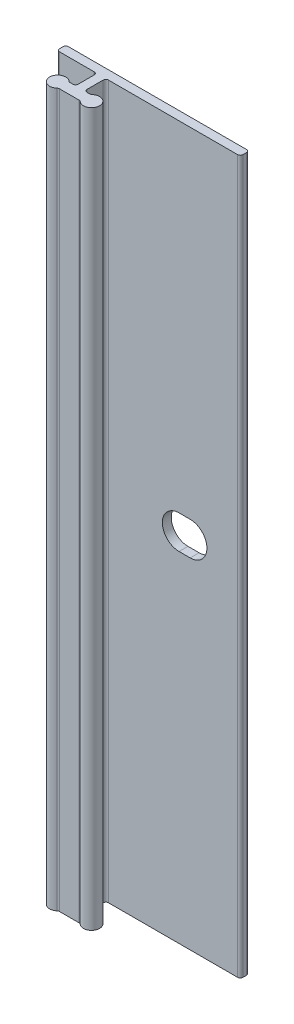
ISO-10303-21;
HEADER;
FILE_DESCRIPTION(('STEP AP214'),'2;1');
FILE_NAME('part.step','',(''),(''),'','','');
FILE_SCHEMA(('AUTOMOTIVE_DESIGN { 1 0 10303 214 1 1 1 1 }'));
ENDSEC;
DATA;
#1=APPLICATION_CONTEXT('core data for automotive mechanical design processes');
#2=APPLICATION_PROTOCOL_DEFINITION('international standard','automotive_design',2000,#1);
#3=PRODUCT_CONTEXT('',#1,'mechanical');
#4=PRODUCT('Part','Part','',(#3));
#5=PRODUCT_RELATED_PRODUCT_CATEGORY('part','',(#4));
#6=PRODUCT_DEFINITION_FORMATION('','',#4);
#7=PRODUCT_DEFINITION_CONTEXT('part definition',#1,'design');
#8=PRODUCT_DEFINITION('design','',#6,#7);
#9=PRODUCT_DEFINITION_SHAPE('','',#8);
#10=(LENGTH_UNIT() NAMED_UNIT(*) SI_UNIT(.MILLI.,.METRE.));
#11=(NAMED_UNIT(*) PLANE_ANGLE_UNIT() SI_UNIT($,.RADIAN.));
#12=(NAMED_UNIT(*) SI_UNIT($,.STERADIAN.) SOLID_ANGLE_UNIT());
#13=UNCERTAINTY_MEASURE_WITH_UNIT(LENGTH_MEASURE(1.E-05),#10,'distance_accuracy_value','');
#14=(GEOMETRIC_REPRESENTATION_CONTEXT(3) GLOBAL_UNCERTAINTY_ASSIGNED_CONTEXT((#13)) GLOBAL_UNIT_ASSIGNED_CONTEXT((#10,
#11,#12)) REPRESENTATION_CONTEXT('',''));
#15=CARTESIAN_POINT('',(0.,0.,0.));
#16=DIRECTION('',(0.,0.,1.));
#17=DIRECTION('',(1.,0.,0.));
#18=AXIS2_PLACEMENT_3D('',#15,#16,#17);
#19=CARTESIAN_POINT('',(-5.96900000000001,50.8,0.381));
#20=DIRECTION('',(0.,-1.,0.));
#21=DIRECTION('',(0.,0.,-1.));
#22=AXIS2_PLACEMENT_3D('',#19,#20,#21);
#23=CYLINDRICAL_SURFACE('',#22,0.381);
#24=CARTESIAN_POINT('',(-5.96900000000001,-50.8,0.381));
#25=DIRECTION('',(0.,1.,0.));
#26=DIRECTION('',(0.,0.,-1.));
#27=AXIS2_PLACEMENT_3D('',#24,#25,#26);
#28=CIRCLE('',#27,0.381);
#29=CARTESIAN_POINT('',(-5.96900000000001,-50.8,0.));
#30=VERTEX_POINT('',#29);
#31=CARTESIAN_POINT('',(-6.35000000000001,-50.8,0.381000000000002));
#32=VERTEX_POINT('',#31);
#33=EDGE_CURVE('E263',#30,#32,#28,.T.);
#34=ORIENTED_EDGE('',*,*,#33,.T.);
#35=DIRECTION('',(0.,-1.,0.));
#36=VECTOR('',#35,1.);
#37=CARTESIAN_POINT('',(-6.35000000000001,50.8,0.381000000000002));
#38=LINE('',#37,#36);
#39=CARTESIAN_POINT('',(-6.35000000000001,50.8,0.381000000000002));
#40=VERTEX_POINT('',#39);
#41=EDGE_CURVE('E13',#40,#32,#38,.T.);
#42=ORIENTED_EDGE('',*,*,#41,.F.);
#43=CARTESIAN_POINT('',(-5.96900000000001,50.8,0.381));
#44=DIRECTION('',(0.,1.,0.));
#45=DIRECTION('',(0.,0.,-1.));
#46=AXIS2_PLACEMENT_3D('',#43,#44,#45);
#47=CIRCLE('',#46,0.381);
#48=CARTESIAN_POINT('',(-5.96900000000001,50.8,0.));
#49=VERTEX_POINT('',#48);
#50=EDGE_CURVE('E267',#49,#40,#47,.T.);
#51=ORIENTED_EDGE('',*,*,#50,.F.);
#52=DIRECTION('',(0.,-1.,0.));
#53=VECTOR('',#52,1.);
#54=CARTESIAN_POINT('',(-5.96900000000001,50.8,0.));
#55=LINE('',#54,#53);
#56=EDGE_CURVE('E317',#49,#30,#55,.T.);
#57=ORIENTED_EDGE('',*,*,#56,.T.);
#58=EDGE_LOOP('',(#34,#42,#51,#57));
#59=FACE_BOUND('',#58,.T.);
#60=ADVANCED_FACE('F46',(#59),#23,.T.);
#61=CARTESIAN_POINT('',(-6.35000000000001,50.8,0.889000000000004));
#62=DIRECTION('',(1.,0.,0.));
#63=DIRECTION('',(0.,0.,-1.));
#64=AXIS2_PLACEMENT_3D('',#61,#62,#63);
#65=PLANE('',#64);
#66=DIRECTION('',(0.,0.,1.));
#67=VECTOR('',#66,1.);
#68=CARTESIAN_POINT('',(-6.35000000000001,-50.8,0.889000000000004));
#69=LINE('',#68,#67);
#70=CARTESIAN_POINT('',(-6.35000000000001,-50.8,0.889000000000004));
#71=VERTEX_POINT('',#70);
#72=EDGE_CURVE('E320',#32,#71,#69,.T.);
#73=ORIENTED_EDGE('',*,*,#72,.T.);
#74=DIRECTION('',(0.,-1.,0.));
#75=VECTOR('',#74,1.);
#76=CARTESIAN_POINT('',(-6.35000000000001,50.8,0.889000000000004));
#77=LINE('',#76,#75);
#78=CARTESIAN_POINT('',(-6.35000000000001,50.8,0.889000000000004));
#79=VERTEX_POINT('',#78);
#80=EDGE_CURVE('E53',#79,#71,#77,.T.);
#81=ORIENTED_EDGE('',*,*,#80,.F.);
#82=DIRECTION('',(0.,0.,1.));
#83=VECTOR('',#82,1.);
#84=CARTESIAN_POINT('',(-6.35000000000001,50.8,0.889000000000004));
#85=LINE('',#84,#83);
#86=EDGE_CURVE('E270',#40,#79,#85,.T.);
#87=ORIENTED_EDGE('',*,*,#86,.F.);
#88=ORIENTED_EDGE('',*,*,#41,.T.);
#89=EDGE_LOOP('',(#73,#81,#87,#88));
#90=FACE_BOUND('',#89,.T.);
#91=ADVANCED_FACE('F457',(#90),#65,.F.);
#92=CARTESIAN_POINT('',(-5.96900000000001,50.8,0.889000000000004));
#93=DIRECTION('',(0.,-1.,0.));
#94=DIRECTION('',(0.,0.,-1.));
#95=AXIS2_PLACEMENT_3D('',#92,#93,#94);
#96=CYLINDRICAL_SURFACE('',#95,0.381000000000001);
#97=CARTESIAN_POINT('',(-5.96900000000001,-50.8,0.889000000000004));
#98=DIRECTION('',(0.,1.,0.));
#99=DIRECTION('',(0.,0.,-1.));
#100=AXIS2_PLACEMENT_3D('',#97,#98,#99);
#101=CIRCLE('',#100,0.381000000000001);
#102=CARTESIAN_POINT('',(-5.96900000000001,-50.8,1.27000000000001));
#103=VERTEX_POINT('',#102);
#104=EDGE_CURVE('E322',#71,#103,#101,.T.);
#105=ORIENTED_EDGE('',*,*,#104,.T.);
#106=DIRECTION('',(0.,-1.,0.));
#107=VECTOR('',#106,1.);
#108=CARTESIAN_POINT('',(-5.96900000000001,50.8,1.27000000000001));
#109=LINE('',#108,#107);
#110=CARTESIAN_POINT('',(-5.96900000000001,50.8,1.27000000000001));
#111=VERTEX_POINT('',#110);
#112=EDGE_CURVE('E427',#111,#103,#109,.T.);
#113=ORIENTED_EDGE('',*,*,#112,.F.);
#114=CARTESIAN_POINT('',(-5.96900000000001,50.8,0.889000000000004));
#115=DIRECTION('',(0.,1.,0.));
#116=DIRECTION('',(0.,0.,-1.));
#117=AXIS2_PLACEMENT_3D('',#114,#115,#116);
#118=CIRCLE('',#117,0.381000000000001);
#119=EDGE_CURVE('E273',#79,#111,#118,.T.);
#120=ORIENTED_EDGE('',*,*,#119,.F.);
#121=ORIENTED_EDGE('',*,*,#80,.T.);
#122=EDGE_LOOP('',(#105,#113,#120,#121));
#123=FACE_BOUND('',#122,.T.);
#124=ADVANCED_FACE('F434',(#123),#96,.T.);
#125=CARTESIAN_POINT('',(-1.016,50.8,1.27));
#126=DIRECTION('',(0.,0.,-1.));
#127=DIRECTION('',(-1.,0.,0.));
#128=AXIS2_PLACEMENT_3D('',#125,#126,#127);
#129=PLANE('',#128);
#130=DIRECTION('',(1.,0.,0.));
#131=VECTOR('',#130,1.);
#132=CARTESIAN_POINT('',(-1.016,-50.8,1.27));
#133=LINE('',#132,#131);
#134=CARTESIAN_POINT('',(-1.016,-50.8,1.27));
#135=VERTEX_POINT('',#134);
#136=EDGE_CURVE('E324',#103,#135,#133,.T.);
#137=ORIENTED_EDGE('',*,*,#136,.T.);
#138=DIRECTION('',(0.,-1.,0.));
#139=VECTOR('',#138,1.);
#140=CARTESIAN_POINT('',(-1.016,50.8,1.27));
#141=LINE('',#140,#139);
#142=CARTESIAN_POINT('',(-1.016,50.8,1.27));
#143=VERTEX_POINT('',#142);
#144=EDGE_CURVE('E424',#143,#135,#141,.T.);
#145=ORIENTED_EDGE('',*,*,#144,.F.);
#146=DIRECTION('',(1.,0.,0.));
#147=VECTOR('',#146,1.);
#148=CARTESIAN_POINT('',(-1.016,50.8,1.27));
#149=LINE('',#148,#147);
#150=EDGE_CURVE('E275',#111,#143,#149,.T.);
#151=ORIENTED_EDGE('',*,*,#150,.F.);
#152=ORIENTED_EDGE('',*,*,#112,.T.);
#153=EDGE_LOOP('',(#137,#145,#151,#152));
#154=FACE_BOUND('',#153,.T.);
#155=ADVANCED_FACE('F445',(#154),#129,.F.);
#156=CARTESIAN_POINT('',(-1.016,50.8,1.651));
#157=DIRECTION('',(0.,-1.,0.));
#158=DIRECTION('',(0.,0.,-1.));
#159=AXIS2_PLACEMENT_3D('',#156,#157,#158);
#160=CYLINDRICAL_SURFACE('',#159,0.381);
#161=CARTESIAN_POINT('',(-1.016,-50.8,1.651));
#162=DIRECTION('',(0.,-1.,0.));
#163=DIRECTION('',(0.,0.,-1.));
#164=AXIS2_PLACEMENT_3D('',#161,#162,#163);
#165=CIRCLE('',#164,0.381);
#166=CARTESIAN_POINT('',(-0.634999999999999,-50.8,1.651));
#167=VERTEX_POINT('',#166);
#168=EDGE_CURVE('E326',#135,#167,#165,.T.);
#169=ORIENTED_EDGE('',*,*,#168,.T.);
#170=DIRECTION('',(0.,-1.,0.));
#171=VECTOR('',#170,1.);
#172=CARTESIAN_POINT('',(-0.634999999999999,50.8,1.651));
#173=LINE('',#172,#171);
#174=CARTESIAN_POINT('',(-0.634999999999999,50.8,1.651));
#175=VERTEX_POINT('',#174);
#176=EDGE_CURVE('E421',#175,#167,#173,.T.);
#177=ORIENTED_EDGE('',*,*,#176,.F.);
#178=CARTESIAN_POINT('',(-1.016,50.8,1.651));
#179=DIRECTION('',(0.,-1.,0.));
#180=DIRECTION('',(0.,0.,-1.));
#181=AXIS2_PLACEMENT_3D('',#178,#179,#180);
#182=CIRCLE('',#181,0.381);
#183=EDGE_CURVE('E277',#143,#175,#182,.T.);
#184=ORIENTED_EDGE('',*,*,#183,.F.);
#185=ORIENTED_EDGE('',*,*,#144,.T.);
#186=EDGE_LOOP('',(#169,#177,#184,#185));
#187=FACE_BOUND('',#186,.T.);
#188=ADVANCED_FACE('F449',(#187),#160,.F.);
#189=CARTESIAN_POINT('',(-0.634999999999999,50.8,1.651));
#190=DIRECTION('',(1.,0.,0.));
#191=DIRECTION('',(0.,0.,-1.));
#192=AXIS2_PLACEMENT_3D('',#189,#190,#191);
#193=PLANE('',#192);
#194=DIRECTION('',(0.,0.,1.));
#195=VECTOR('',#194,1.);
#196=CARTESIAN_POINT('',(-0.634999999999999,-50.8,1.651));
#197=LINE('',#196,#195);
#198=CARTESIAN_POINT('',(-0.634999999999999,-50.8,3.937));
#199=VERTEX_POINT('',#198);
#200=EDGE_CURVE('E328',#167,#199,#197,.T.);
#201=ORIENTED_EDGE('',*,*,#200,.T.);
#202=DIRECTION('',(0.,-1.,0.));
#203=VECTOR('',#202,1.);
#204=CARTESIAN_POINT('',(-0.634999999999999,50.8,3.937));
#205=LINE('',#204,#203);
#206=CARTESIAN_POINT('',(-0.634999999999999,50.8,3.937));
#207=VERTEX_POINT('',#206);
#208=EDGE_CURVE('E418',#207,#199,#205,.T.);
#209=ORIENTED_EDGE('',*,*,#208,.F.);
#210=DIRECTION('',(0.,0.,1.));
#211=VECTOR('',#210,1.);
#212=CARTESIAN_POINT('',(-0.634999999999999,50.8,1.651));
#213=LINE('',#212,#211);
#214=EDGE_CURVE('E279',#175,#207,#213,.T.);
#215=ORIENTED_EDGE('',*,*,#214,.F.);
#216=ORIENTED_EDGE('',*,*,#176,.T.);
#217=EDGE_LOOP('',(#201,#209,#215,#216));
#218=FACE_BOUND('',#217,.T.);
#219=ADVANCED_FACE('F548',(#218),#193,.F.);
#220=CARTESIAN_POINT('',(-1.016,50.8,3.937));
#221=DIRECTION('',(0.,-1.,0.));
#222=DIRECTION('',(0.,0.,-1.));
#223=AXIS2_PLACEMENT_3D('',#220,#221,#222);
#224=CYLINDRICAL_SURFACE('',#223,0.381);
#225=CARTESIAN_POINT('',(-1.016,-50.8,3.937));
#226=DIRECTION('',(0.,-1.,0.));
#227=DIRECTION('',(0.,0.,-1.));
#228=AXIS2_PLACEMENT_3D('',#225,#226,#227);
#229=CIRCLE('',#228,0.381);
#230=CARTESIAN_POINT('',(-1.016,-50.8,4.318));
#231=VERTEX_POINT('',#230);
#232=EDGE_CURVE('E330',#199,#231,#229,.T.);
#233=ORIENTED_EDGE('',*,*,#232,.T.);
#234=DIRECTION('',(0.,-1.,0.));
#235=VECTOR('',#234,1.);
#236=CARTESIAN_POINT('',(-1.016,50.8,4.318));
#237=LINE('',#236,#235);
#238=CARTESIAN_POINT('',(-1.016,50.8,4.318));
#239=VERTEX_POINT('',#238);
#240=EDGE_CURVE('E415',#239,#231,#237,.T.);
#241=ORIENTED_EDGE('',*,*,#240,.F.);
#242=CARTESIAN_POINT('',(-1.016,50.8,3.937));
#243=DIRECTION('',(0.,-1.,0.));
#244=DIRECTION('',(0.,0.,-1.));
#245=AXIS2_PLACEMENT_3D('',#242,#243,#244);
#246=CIRCLE('',#245,0.381);
#247=EDGE_CURVE('E281',#207,#239,#246,.T.);
#248=ORIENTED_EDGE('',*,*,#247,.F.);
#249=ORIENTED_EDGE('',*,*,#208,.T.);
#250=EDGE_LOOP('',(#233,#241,#248,#249));
#251=FACE_BOUND('',#250,.T.);
#252=ADVANCED_FACE('F546',(#251),#224,.F.);
#253=CARTESIAN_POINT('',(-1.40496875048439,50.8,4.318));
#254=DIRECTION('',(0.,0.,1.));
#255=DIRECTION('',(1.,0.,0.));
#256=AXIS2_PLACEMENT_3D('',#253,#254,#255);
#257=PLANE('',#256);
#258=DIRECTION('',(-1.,0.,0.));
#259=VECTOR('',#258,1.);
#260=CARTESIAN_POINT('',(-1.40496875048439,-50.8,4.318));
#261=LINE('',#260,#259);
#262=CARTESIAN_POINT('',(-1.40496875048439,-50.8,4.318));
#263=VERTEX_POINT('',#262);
#264=EDGE_CURVE('E332',#231,#263,#261,.T.);
#265=ORIENTED_EDGE('',*,*,#264,.T.);
#266=DIRECTION('',(0.,-1.,0.));
#267=VECTOR('',#266,1.);
#268=CARTESIAN_POINT('',(-1.40496875048439,50.8,4.318));
#269=LINE('',#268,#267);
#270=CARTESIAN_POINT('',(-1.40496875048439,50.8,4.318));
#271=VERTEX_POINT('',#270);
#272=EDGE_CURVE('E412',#271,#263,#269,.T.);
#273=ORIENTED_EDGE('',*,*,#272,.F.);
#274=DIRECTION('',(-1.,0.,0.));
#275=VECTOR('',#274,1.);
#276=CARTESIAN_POINT('',(-1.40496875048439,50.8,4.318));
#277=LINE('',#276,#275);
#278=EDGE_CURVE('E283',#239,#271,#277,.T.);
#279=ORIENTED_EDGE('',*,*,#278,.F.);
#280=ORIENTED_EDGE('',*,*,#240,.T.);
#281=EDGE_LOOP('',(#265,#273,#279,#280));
#282=FACE_BOUND('',#281,.T.);
#283=ADVANCED_FACE('F542',(#282),#257,.F.);
#284=CARTESIAN_POINT('',(-1.40496875048439,50.8,3.937));
#285=DIRECTION('',(0.,-1.,0.));
#286=DIRECTION('',(0.,0.,-1.));
#287=AXIS2_PLACEMENT_3D('',#284,#285,#286);
#288=CYLINDRICAL_SURFACE('',#287,0.381);
#289=CARTESIAN_POINT('',(-1.40496875048439,-50.8,3.937));
#290=DIRECTION('',(0.,-1.,0.));
#291=DIRECTION('',(0.,0.,-1.));
#292=AXIS2_PLACEMENT_3D('',#289,#290,#291);
#293=CIRCLE('',#292,0.381);
#294=CARTESIAN_POINT('',(-1.65697656286329,-50.8,4.22275));
#295=VERTEX_POINT('',#294);
#296=EDGE_CURVE('E334',#263,#295,#293,.T.);
#297=ORIENTED_EDGE('',*,*,#296,.T.);
#298=DIRECTION('',(0.,-1.,0.));
#299=VECTOR('',#298,1.);
#300=CARTESIAN_POINT('',(-1.65697656286329,50.8,4.22275));
#301=LINE('',#300,#299);
#302=CARTESIAN_POINT('',(-1.65697656286329,50.8,4.22275));
#303=VERTEX_POINT('',#302);
#304=EDGE_CURVE('E409',#303,#295,#301,.T.);
#305=ORIENTED_EDGE('',*,*,#304,.F.);
#306=CARTESIAN_POINT('',(-1.40496875048439,50.8,3.937));
#307=DIRECTION('',(0.,-1.,0.));
#308=DIRECTION('',(0.,0.,-1.));
#309=AXIS2_PLACEMENT_3D('',#306,#307,#308);
#310=CIRCLE('',#309,0.381);
#311=EDGE_CURVE('E285',#271,#303,#310,.T.);
#312=ORIENTED_EDGE('',*,*,#311,.F.);
#313=ORIENTED_EDGE('',*,*,#272,.T.);
#314=EDGE_LOOP('',(#297,#305,#312,#313));
#315=FACE_BOUND('',#314,.T.);
#316=ADVANCED_FACE('F537',(#315),#288,.F.);
#317=CARTESIAN_POINT('',(-2.413,50.8,5.08));
#318=DIRECTION('',(0.,-1.,0.));
#319=DIRECTION('',(0.,0.,-1.));
#320=AXIS2_PLACEMENT_3D('',#317,#318,#319);
#321=CYLINDRICAL_SURFACE('',#320,1.143);
#322=CARTESIAN_POINT('',(-2.413,-50.8,5.08));
#323=DIRECTION('',(0.,1.,0.));
#324=DIRECTION('',(0.,0.,1.));
#325=AXIS2_PLACEMENT_3D('',#322,#323,#324);
#326=CIRCLE('',#325,1.143);
#327=CARTESIAN_POINT('',(-1.65697656286329,-50.8,5.93725));
#328=VERTEX_POINT('',#327);
#329=EDGE_CURVE('E336',#295,#328,#326,.T.);
#330=ORIENTED_EDGE('',*,*,#329,.T.);
#331=DIRECTION('',(0.,-1.,0.));
#332=VECTOR('',#331,1.);
#333=CARTESIAN_POINT('',(-1.65697656286329,50.8,5.93725));
#334=LINE('',#333,#332);
#335=CARTESIAN_POINT('',(-1.65697656286329,50.8,5.93725));
#336=VERTEX_POINT('',#335);
#337=EDGE_CURVE('E406',#336,#328,#334,.T.);
#338=ORIENTED_EDGE('',*,*,#337,.F.);
#339=CARTESIAN_POINT('',(-2.413,50.8,5.08));
#340=DIRECTION('',(0.,1.,0.));
#341=DIRECTION('',(0.,0.,1.));
#342=AXIS2_PLACEMENT_3D('',#339,#340,#341);
#343=CIRCLE('',#342,1.143);
#344=EDGE_CURVE('E287',#303,#336,#343,.T.);
#345=ORIENTED_EDGE('',*,*,#344,.F.);
#346=ORIENTED_EDGE('',*,*,#304,.T.);
#347=EDGE_LOOP('',(#330,#338,#345,#346));
#348=FACE_BOUND('',#347,.T.);
#349=ADVANCED_FACE('F531',(#348),#321,.T.);
#350=CARTESIAN_POINT('',(-1.40496875048439,50.8,6.223));
#351=DIRECTION('',(0.,-1.,0.));
#352=DIRECTION('',(0.,0.,-1.));
#353=AXIS2_PLACEMENT_3D('',#350,#351,#352);
#354=CYLINDRICAL_SURFACE('',#353,0.381);
#355=CARTESIAN_POINT('',(-1.40496875048439,-50.8,6.223));
#356=DIRECTION('',(0.,-1.,0.));
#357=DIRECTION('',(0.,0.,1.));
#358=AXIS2_PLACEMENT_3D('',#355,#356,#357);
#359=CIRCLE('',#358,0.381);
#360=CARTESIAN_POINT('',(-1.40496875048439,-50.8,5.842));
#361=VERTEX_POINT('',#360);
#362=EDGE_CURVE('E338',#328,#361,#359,.T.);
#363=ORIENTED_EDGE('',*,*,#362,.T.);
#364=DIRECTION('',(0.,-1.,0.));
#365=VECTOR('',#364,1.);
#366=CARTESIAN_POINT('',(-1.40496875048439,50.8,5.842));
#367=LINE('',#366,#365);
#368=CARTESIAN_POINT('',(-1.40496875048439,50.8,5.842));
#369=VERTEX_POINT('',#368);
#370=EDGE_CURVE('E403',#369,#361,#367,.T.);
#371=ORIENTED_EDGE('',*,*,#370,.F.);
#372=CARTESIAN_POINT('',(-1.40496875048439,50.8,6.223));
#373=DIRECTION('',(0.,-1.,0.));
#374=DIRECTION('',(0.,0.,1.));
#375=AXIS2_PLACEMENT_3D('',#372,#373,#374);
#376=CIRCLE('',#375,0.381);
#377=EDGE_CURVE('E289',#336,#369,#376,.T.);
#378=ORIENTED_EDGE('',*,*,#377,.F.);
#379=ORIENTED_EDGE('',*,*,#337,.T.);
#380=EDGE_LOOP('',(#363,#371,#378,#379));
#381=FACE_BOUND('',#380,.T.);
#382=ADVANCED_FACE('F527',(#381),#354,.F.);
#383=CARTESIAN_POINT('',(-1.40496875048439,50.8,5.842));
#384=DIRECTION('',(0.,0.,-1.));
#385=DIRECTION('',(-1.,0.,0.));
#386=AXIS2_PLACEMENT_3D('',#383,#384,#385);
#387=PLANE('',#386);
#388=DIRECTION('',(1.,0.,0.));
#389=VECTOR('',#388,1.);
#390=CARTESIAN_POINT('',(-1.40496875048439,-50.8,5.842));
#391=LINE('',#390,#389);
#392=CARTESIAN_POINT('',(1.40496875048439,-50.8,5.842));
#393=VERTEX_POINT('',#392);
#394=EDGE_CURVE('E340',#361,#393,#391,.T.);
#395=ORIENTED_EDGE('',*,*,#394,.T.);
#396=DIRECTION('',(0.,-1.,0.));
#397=VECTOR('',#396,1.);
#398=CARTESIAN_POINT('',(1.40496875048439,50.8,5.842));
#399=LINE('',#398,#397);
#400=CARTESIAN_POINT('',(1.40496875048439,50.8,5.842));
#401=VERTEX_POINT('',#400);
#402=EDGE_CURVE('E400',#401,#393,#399,.T.);
#403=ORIENTED_EDGE('',*,*,#402,.F.);
#404=DIRECTION('',(1.,0.,0.));
#405=VECTOR('',#404,1.);
#406=CARTESIAN_POINT('',(-1.40496875048439,50.8,5.842));
#407=LINE('',#406,#405);
#408=EDGE_CURVE('E291',#369,#401,#407,.T.);
#409=ORIENTED_EDGE('',*,*,#408,.F.);
#410=ORIENTED_EDGE('',*,*,#370,.T.);
#411=EDGE_LOOP('',(#395,#403,#409,#410));
#412=FACE_BOUND('',#411,.T.);
#413=ADVANCED_FACE('F522',(#412),#387,.F.);
#414=CARTESIAN_POINT('',(1.40496875048439,50.8,6.223));
#415=DIRECTION('',(0.,-1.,0.));
#416=DIRECTION('',(0.,0.,-1.));
#417=AXIS2_PLACEMENT_3D('',#414,#415,#416);
#418=CYLINDRICAL_SURFACE('',#417,0.381);
#419=CARTESIAN_POINT('',(1.40496875048439,-50.8,6.223));
#420=DIRECTION('',(0.,-1.,0.));
#421=DIRECTION('',(0.,0.,-1.));
#422=AXIS2_PLACEMENT_3D('',#419,#420,#421);
#423=CIRCLE('',#422,0.381);
#424=CARTESIAN_POINT('',(1.65697656286329,-50.8,5.93725));
#425=VERTEX_POINT('',#424);
#426=EDGE_CURVE('E342',#393,#425,#423,.T.);
#427=ORIENTED_EDGE('',*,*,#426,.T.);
#428=DIRECTION('',(0.,-1.,0.));
#429=VECTOR('',#428,1.);
#430=CARTESIAN_POINT('',(1.65697656286329,50.8,5.93725));
#431=LINE('',#430,#429);
#432=CARTESIAN_POINT('',(1.65697656286329,50.8,5.93725));
#433=VERTEX_POINT('',#432);
#434=EDGE_CURVE('E397',#433,#425,#431,.T.);
#435=ORIENTED_EDGE('',*,*,#434,.F.);
#436=CARTESIAN_POINT('',(1.40496875048439,50.8,6.223));
#437=DIRECTION('',(0.,-1.,0.));
#438=DIRECTION('',(0.,0.,-1.));
#439=AXIS2_PLACEMENT_3D('',#436,#437,#438);
#440=CIRCLE('',#439,0.381);
#441=EDGE_CURVE('E293',#401,#433,#440,.T.);
#442=ORIENTED_EDGE('',*,*,#441,.F.);
#443=ORIENTED_EDGE('',*,*,#402,.T.);
#444=EDGE_LOOP('',(#427,#435,#442,#443));
#445=FACE_BOUND('',#444,.T.);
#446=ADVANCED_FACE('F516',(#445),#418,.F.);
#447=CARTESIAN_POINT('',(2.413,50.8,5.08));
#448=DIRECTION('',(0.,-1.,0.));
#449=DIRECTION('',(0.,0.,-1.));
#450=AXIS2_PLACEMENT_3D('',#447,#448,#449);
#451=CYLINDRICAL_SURFACE('',#450,1.143);
#452=CARTESIAN_POINT('',(2.413,-50.8,5.08));
#453=DIRECTION('',(0.,1.,0.));
#454=DIRECTION('',(0.,0.,1.));
#455=AXIS2_PLACEMENT_3D('',#452,#453,#454);
#456=CIRCLE('',#455,1.143);
#457=CARTESIAN_POINT('',(1.6569765628633,-50.8,4.22275));
#458=VERTEX_POINT('',#457);
#459=EDGE_CURVE('E344',#425,#458,#456,.T.);
#460=ORIENTED_EDGE('',*,*,#459,.T.);
#461=DIRECTION('',(0.,-1.,0.));
#462=VECTOR('',#461,1.);
#463=CARTESIAN_POINT('',(1.6569765628633,50.8,4.22275));
#464=LINE('',#463,#462);
#465=CARTESIAN_POINT('',(1.6569765628633,50.8,4.22275));
#466=VERTEX_POINT('',#465);
#467=EDGE_CURVE('E394',#466,#458,#464,.T.);
#468=ORIENTED_EDGE('',*,*,#467,.F.);
#469=CARTESIAN_POINT('',(2.413,50.8,5.08));
#470=DIRECTION('',(0.,1.,0.));
#471=DIRECTION('',(0.,0.,1.));
#472=AXIS2_PLACEMENT_3D('',#469,#470,#471);
#473=CIRCLE('',#472,1.143);
#474=EDGE_CURVE('E295',#433,#466,#473,.T.);
#475=ORIENTED_EDGE('',*,*,#474,.F.);
#476=ORIENTED_EDGE('',*,*,#434,.T.);
#477=EDGE_LOOP('',(#460,#468,#475,#476));
#478=FACE_BOUND('',#477,.T.);
#479=ADVANCED_FACE('F512',(#478),#451,.T.);
#480=CARTESIAN_POINT('',(1.40496875048439,50.8,3.937));
#481=DIRECTION('',(0.,-1.,0.));
#482=DIRECTION('',(0.,0.,-1.));
#483=AXIS2_PLACEMENT_3D('',#480,#481,#482);
#484=CYLINDRICAL_SURFACE('',#483,0.381000000000001);
#485=CARTESIAN_POINT('',(1.40496875048439,-50.8,3.937));
#486=DIRECTION('',(0.,-1.,0.));
#487=DIRECTION('',(0.,0.,-1.));
#488=AXIS2_PLACEMENT_3D('',#485,#486,#487);
#489=CIRCLE('',#488,0.381000000000001);
#490=CARTESIAN_POINT('',(1.40496875048439,-50.8,4.318));
#491=VERTEX_POINT('',#490);
#492=EDGE_CURVE('E346',#458,#491,#489,.T.);
#493=ORIENTED_EDGE('',*,*,#492,.T.);
#494=DIRECTION('',(0.,-1.,0.));
#495=VECTOR('',#494,1.);
#496=CARTESIAN_POINT('',(1.40496875048439,50.8,4.318));
#497=LINE('',#496,#495);
#498=CARTESIAN_POINT('',(1.40496875048439,50.8,4.318));
#499=VERTEX_POINT('',#498);
#500=EDGE_CURVE('E391',#499,#491,#497,.T.);
#501=ORIENTED_EDGE('',*,*,#500,.F.);
#502=CARTESIAN_POINT('',(1.40496875048439,50.8,3.937));
#503=DIRECTION('',(0.,-1.,0.));
#504=DIRECTION('',(0.,0.,-1.));
#505=AXIS2_PLACEMENT_3D('',#502,#503,#504);
#506=CIRCLE('',#505,0.381000000000001);
#507=EDGE_CURVE('E297',#466,#499,#506,.T.);
#508=ORIENTED_EDGE('',*,*,#507,.F.);
#509=ORIENTED_EDGE('',*,*,#467,.T.);
#510=EDGE_LOOP('',(#493,#501,#508,#509));
#511=FACE_BOUND('',#510,.T.);
#512=ADVANCED_FACE('F507',(#511),#484,.F.);
#513=CARTESIAN_POINT('',(1.016,50.8,4.318));
#514=DIRECTION('',(0.,0.,1.));
#515=DIRECTION('',(1.,0.,0.));
#516=AXIS2_PLACEMENT_3D('',#513,#514,#515);
#517=PLANE('',#516);
#518=DIRECTION('',(-1.,0.,0.));
#519=VECTOR('',#518,1.);
#520=CARTESIAN_POINT('',(1.016,-50.8,4.318));
#521=LINE('',#520,#519);
#522=CARTESIAN_POINT('',(1.016,-50.8,4.318));
#523=VERTEX_POINT('',#522);
#524=EDGE_CURVE('E348',#491,#523,#521,.T.);
#525=ORIENTED_EDGE('',*,*,#524,.T.);
#526=DIRECTION('',(0.,-1.,0.));
#527=VECTOR('',#526,1.);
#528=CARTESIAN_POINT('',(1.016,50.8,4.318));
#529=LINE('',#528,#527);
#530=CARTESIAN_POINT('',(1.016,50.8,4.318));
#531=VERTEX_POINT('',#530);
#532=EDGE_CURVE('E388',#531,#523,#529,.T.);
#533=ORIENTED_EDGE('',*,*,#532,.F.);
#534=DIRECTION('',(-1.,0.,0.));
#535=VECTOR('',#534,1.);
#536=CARTESIAN_POINT('',(1.016,50.8,4.318));
#537=LINE('',#536,#535);
#538=EDGE_CURVE('E299',#499,#531,#537,.T.);
#539=ORIENTED_EDGE('',*,*,#538,.F.);
#540=ORIENTED_EDGE('',*,*,#500,.T.);
#541=EDGE_LOOP('',(#525,#533,#539,#540));
#542=FACE_BOUND('',#541,.T.);
#543=ADVANCED_FACE('F501',(#542),#517,.F.);
#544=CARTESIAN_POINT('',(1.016,50.8,3.937));
#545=DIRECTION('',(0.,-1.,0.));
#546=DIRECTION('',(0.,0.,-1.));
#547=AXIS2_PLACEMENT_3D('',#544,#545,#546);
#548=CYLINDRICAL_SURFACE('',#547,0.381);
#549=CARTESIAN_POINT('',(1.016,-50.8,3.937));
#550=DIRECTION('',(0.,-1.,0.));
#551=DIRECTION('',(0.,0.,1.));
#552=AXIS2_PLACEMENT_3D('',#549,#550,#551);
#553=CIRCLE('',#552,0.381);
#554=CARTESIAN_POINT('',(0.635000000000002,-50.8,3.937));
#555=VERTEX_POINT('',#554);
#556=EDGE_CURVE('E350',#523,#555,#553,.T.);
#557=ORIENTED_EDGE('',*,*,#556,.T.);
#558=DIRECTION('',(0.,-1.,0.));
#559=VECTOR('',#558,1.);
#560=CARTESIAN_POINT('',(0.635000000000002,50.8,3.937));
#561=LINE('',#560,#559);
#562=CARTESIAN_POINT('',(0.635000000000002,50.8,3.937));
#563=VERTEX_POINT('',#562);
#564=EDGE_CURVE('E385',#563,#555,#561,.T.);
#565=ORIENTED_EDGE('',*,*,#564,.F.);
#566=CARTESIAN_POINT('',(1.016,50.8,3.937));
#567=DIRECTION('',(0.,-1.,0.));
#568=DIRECTION('',(0.,0.,1.));
#569=AXIS2_PLACEMENT_3D('',#566,#567,#568);
#570=CIRCLE('',#569,0.381);
#571=EDGE_CURVE('E301',#531,#563,#570,.T.);
#572=ORIENTED_EDGE('',*,*,#571,.F.);
#573=ORIENTED_EDGE('',*,*,#532,.T.);
#574=EDGE_LOOP('',(#557,#565,#572,#573));
#575=FACE_BOUND('',#574,.T.);
#576=ADVANCED_FACE('F497',(#575),#548,.F.);
#577=CARTESIAN_POINT('',(0.635000000000001,50.8,1.651));
#578=DIRECTION('',(-1.,0.,0.));
#579=DIRECTION('',(0.,0.,1.));
#580=AXIS2_PLACEMENT_3D('',#577,#578,#579);
#581=PLANE('',#580);
#582=DIRECTION('',(0.,0.,-1.));
#583=VECTOR('',#582,1.);
#584=CARTESIAN_POINT('',(0.635000000000001,-50.8,1.651));
#585=LINE('',#584,#583);
#586=CARTESIAN_POINT('',(0.635000000000001,-50.8,1.651));
#587=VERTEX_POINT('',#586);
#588=EDGE_CURVE('E352',#555,#587,#585,.T.);
#589=ORIENTED_EDGE('',*,*,#588,.T.);
#590=DIRECTION('',(0.,-1.,0.));
#591=VECTOR('',#590,1.);
#592=CARTESIAN_POINT('',(0.635000000000001,50.8,1.651));
#593=LINE('',#592,#591);
#594=CARTESIAN_POINT('',(0.635000000000001,50.8,1.651));
#595=VERTEX_POINT('',#594);
#596=EDGE_CURVE('E382',#595,#587,#593,.T.);
#597=ORIENTED_EDGE('',*,*,#596,.F.);
#598=DIRECTION('',(0.,0.,-1.));
#599=VECTOR('',#598,1.);
#600=CARTESIAN_POINT('',(0.635000000000001,50.8,1.651));
#601=LINE('',#600,#599);
#602=EDGE_CURVE('E303',#563,#595,#601,.T.);
#603=ORIENTED_EDGE('',*,*,#602,.F.);
#604=ORIENTED_EDGE('',*,*,#564,.T.);
#605=EDGE_LOOP('',(#589,#597,#603,#604));
#606=FACE_BOUND('',#605,.T.);
#607=ADVANCED_FACE('F492',(#606),#581,.F.);
#608=CARTESIAN_POINT('',(1.016,50.8,1.651));
#609=DIRECTION('',(0.,-1.,0.));
#610=DIRECTION('',(0.,0.,-1.));
#611=AXIS2_PLACEMENT_3D('',#608,#609,#610);
#612=CYLINDRICAL_SURFACE('',#611,0.381000000000001);
#613=CARTESIAN_POINT('',(1.016,-50.8,1.651));
#614=DIRECTION('',(0.,-1.,0.));
#615=DIRECTION('',(0.,0.,1.));
#616=AXIS2_PLACEMENT_3D('',#613,#614,#615);
#617=CIRCLE('',#616,0.381000000000001);
#618=CARTESIAN_POINT('',(1.016,-50.8,1.27));
#619=VERTEX_POINT('',#618);
#620=EDGE_CURVE('E354',#587,#619,#617,.T.);
#621=ORIENTED_EDGE('',*,*,#620,.T.);
#622=DIRECTION('',(0.,-1.,0.));
#623=VECTOR('',#622,1.);
#624=CARTESIAN_POINT('',(1.016,50.8,1.27));
#625=LINE('',#624,#623);
#626=CARTESIAN_POINT('',(1.016,50.8,1.27));
#627=VERTEX_POINT('',#626);
#628=EDGE_CURVE('E379',#627,#619,#625,.T.);
#629=ORIENTED_EDGE('',*,*,#628,.F.);
#630=CARTESIAN_POINT('',(1.016,50.8,1.651));
#631=DIRECTION('',(0.,-1.,0.));
#632=DIRECTION('',(0.,0.,1.));
#633=AXIS2_PLACEMENT_3D('',#630,#631,#632);
#634=CIRCLE('',#633,0.381000000000001);
#635=EDGE_CURVE('E305',#595,#627,#634,.T.);
#636=ORIENTED_EDGE('',*,*,#635,.F.);
#637=ORIENTED_EDGE('',*,*,#596,.T.);
#638=EDGE_LOOP('',(#621,#629,#636,#637));
#639=FACE_BOUND('',#638,.T.);
#640=ADVANCED_FACE('F486',(#639),#612,.F.);
#641=CARTESIAN_POINT('',(19.431,50.8,1.27));
#642=DIRECTION('',(0.,0.,-1.));
#643=DIRECTION('',(-1.,0.,0.));
#644=AXIS2_PLACEMENT_3D('',#641,#642,#643);
#645=PLANE('',#644);
#646=DIRECTION('',(1.,0.,0.));
#647=VECTOR('',#646,1.);
#648=CARTESIAN_POINT('',(11.08075,-2.38125,1.27));
#649=LINE('',#648,#647);
#650=CARTESIAN_POINT('',(11.08075,-2.38125,1.27));
#651=VERTEX_POINT('',#650);
#652=CARTESIAN_POINT('',(12.66825,-2.38125,1.27));
#653=VERTEX_POINT('',#652);
#654=EDGE_CURVE('E257',#651,#653,#649,.T.);
#655=ORIENTED_EDGE('',*,*,#654,.F.);
#656=CARTESIAN_POINT('',(11.08075,0.,1.27));
#657=DIRECTION('',(0.,0.,1.));
#658=DIRECTION('',(1.,0.,0.));
#659=AXIS2_PLACEMENT_3D('',#656,#657,#658);
#660=CIRCLE('',#659,2.38125);
#661=CARTESIAN_POINT('',(11.08075,2.38125,1.27));
#662=VERTEX_POINT('',#661);
#663=EDGE_CURVE('E60',#662,#651,#660,.T.);
#664=ORIENTED_EDGE('',*,*,#663,.F.);
#665=DIRECTION('',(-1.,0.,0.));
#666=VECTOR('',#665,1.);
#667=CARTESIAN_POINT('',(11.08075,2.38125,1.27));
#668=LINE('',#667,#666);
#669=CARTESIAN_POINT('',(12.66825,2.38125,1.27));
#670=VERTEX_POINT('',#669);
#671=EDGE_CURVE('E248',#670,#662,#668,.T.);
#672=ORIENTED_EDGE('',*,*,#671,.F.);
#673=CARTESIAN_POINT('',(12.66825,0.,1.27));
#674=DIRECTION('',(0.,0.,1.));
#675=DIRECTION('',(1.,0.,0.));
#676=AXIS2_PLACEMENT_3D('',#673,#674,#675);
#677=CIRCLE('',#676,2.38125);
#678=EDGE_CURVE('E251',#653,#670,#677,.T.);
#679=ORIENTED_EDGE('',*,*,#678,.F.);
#680=EDGE_LOOP('',(#655,#664,#672,#679));
#681=FACE_BOUND('',#680,.T.);
#682=DIRECTION('',(1.,0.,0.));
#683=VECTOR('',#682,1.);
#684=CARTESIAN_POINT('',(19.431,-50.8,1.27));
#685=LINE('',#684,#683);
#686=CARTESIAN_POINT('',(19.431,-50.8,1.27));
#687=VERTEX_POINT('',#686);
#688=EDGE_CURVE('E356',#619,#687,#685,.T.);
#689=ORIENTED_EDGE('',*,*,#688,.T.);
#690=DIRECTION('',(0.,-1.,0.));
#691=VECTOR('',#690,1.);
#692=CARTESIAN_POINT('',(19.431,50.8,1.27));
#693=LINE('',#692,#691);
#694=CARTESIAN_POINT('',(19.431,50.8,1.27));
#695=VERTEX_POINT('',#694);
#696=EDGE_CURVE('E376',#695,#687,#693,.T.);
#697=ORIENTED_EDGE('',*,*,#696,.F.);
#698=DIRECTION('',(1.,0.,0.));
#699=VECTOR('',#698,1.);
#700=CARTESIAN_POINT('',(19.431,50.8,1.27));
#701=LINE('',#700,#699);
#702=EDGE_CURVE('E307',#627,#695,#701,.T.);
#703=ORIENTED_EDGE('',*,*,#702,.F.);
#704=ORIENTED_EDGE('',*,*,#628,.T.);
#705=EDGE_LOOP('',(#689,#697,#703,#704));
#706=FACE_BOUND('',#705,.T.);
#707=ADVANCED_FACE('F482',(#681,#706),#645,.F.);
#708=CARTESIAN_POINT('',(19.431,50.8,0.889));
#709=DIRECTION('',(0.,-1.,0.));
#710=DIRECTION('',(0.,0.,-1.));
#711=AXIS2_PLACEMENT_3D('',#708,#709,#710);
#712=CYLINDRICAL_SURFACE('',#711,0.381000000000002);
#713=CARTESIAN_POINT('',(19.431,-50.8,0.889));
#714=DIRECTION('',(0.,1.,0.));
#715=DIRECTION('',(0.,0.,-1.));
#716=AXIS2_PLACEMENT_3D('',#713,#714,#715);
#717=CIRCLE('',#716,0.381000000000002);
#718=CARTESIAN_POINT('',(19.812,-50.8,0.889));
#719=VERTEX_POINT('',#718);
#720=EDGE_CURVE('E358',#687,#719,#717,.T.);
#721=ORIENTED_EDGE('',*,*,#720,.T.);
#722=DIRECTION('',(0.,-1.,0.));
#723=VECTOR('',#722,1.);
#724=CARTESIAN_POINT('',(19.812,50.8,0.889));
#725=LINE('',#724,#723);
#726=CARTESIAN_POINT('',(19.812,50.8,0.889));
#727=VERTEX_POINT('',#726);
#728=EDGE_CURVE('E373',#727,#719,#725,.T.);
#729=ORIENTED_EDGE('',*,*,#728,.F.);
#730=CARTESIAN_POINT('',(19.431,50.8,0.889));
#731=DIRECTION('',(0.,1.,0.));
#732=DIRECTION('',(0.,0.,-1.));
#733=AXIS2_PLACEMENT_3D('',#730,#731,#732);
#734=CIRCLE('',#733,0.381000000000002);
#735=EDGE_CURVE('E309',#695,#727,#734,.T.);
#736=ORIENTED_EDGE('',*,*,#735,.F.);
#737=ORIENTED_EDGE('',*,*,#696,.T.);
#738=EDGE_LOOP('',(#721,#729,#736,#737));
#739=FACE_BOUND('',#738,.T.);
#740=ADVANCED_FACE('F477',(#739),#712,.T.);
#741=CARTESIAN_POINT('',(19.812,50.8,0.381));
#742=DIRECTION('',(-1.,0.,0.));
#743=DIRECTION('',(0.,0.,1.));
#744=AXIS2_PLACEMENT_3D('',#741,#742,#743);
#745=PLANE('',#744);
#746=DIRECTION('',(0.,0.,-1.));
#747=VECTOR('',#746,1.);
#748=CARTESIAN_POINT('',(19.812,-50.8,0.381));
#749=LINE('',#748,#747);
#750=CARTESIAN_POINT('',(19.812,-50.8,0.381));
#751=VERTEX_POINT('',#750);
#752=EDGE_CURVE('E360',#719,#751,#749,.T.);
#753=ORIENTED_EDGE('',*,*,#752,.T.);
#754=DIRECTION('',(0.,-1.,0.));
#755=VECTOR('',#754,1.);
#756=CARTESIAN_POINT('',(19.812,50.8,0.381));
#757=LINE('',#756,#755);
#758=CARTESIAN_POINT('',(19.812,50.8,0.381));
#759=VERTEX_POINT('',#758);
#760=EDGE_CURVE('E370',#759,#751,#757,.T.);
#761=ORIENTED_EDGE('',*,*,#760,.F.);
#762=DIRECTION('',(0.,0.,-1.));
#763=VECTOR('',#762,1.);
#764=CARTESIAN_POINT('',(19.812,50.8,0.381));
#765=LINE('',#764,#763);
#766=EDGE_CURVE('E311',#727,#759,#765,.T.);
#767=ORIENTED_EDGE('',*,*,#766,.F.);
#768=ORIENTED_EDGE('',*,*,#728,.T.);
#769=EDGE_LOOP('',(#753,#761,#767,#768));
#770=FACE_BOUND('',#769,.T.);
#771=ADVANCED_FACE('F471',(#770),#745,.F.);
#772=CARTESIAN_POINT('',(19.431,50.8,0.381));
#773=DIRECTION('',(0.,-1.,0.));
#774=DIRECTION('',(0.,0.,-1.));
#775=AXIS2_PLACEMENT_3D('',#772,#773,#774);
#776=CYLINDRICAL_SURFACE('',#775,0.381000000000002);
#777=CARTESIAN_POINT('',(19.431,-50.8,0.381));
#778=DIRECTION('',(0.,1.,0.));
#779=DIRECTION('',(0.,0.,-1.));
#780=AXIS2_PLACEMENT_3D('',#777,#778,#779);
#781=CIRCLE('',#780,0.381000000000002);
#782=CARTESIAN_POINT('',(19.431,-50.8,0.));
#783=VERTEX_POINT('',#782);
#784=EDGE_CURVE('E362',#751,#783,#781,.T.);
#785=ORIENTED_EDGE('',*,*,#784,.T.);
#786=DIRECTION('',(0.,-1.,0.));
#787=VECTOR('',#786,1.);
#788=CARTESIAN_POINT('',(19.431,50.8,0.));
#789=LINE('',#788,#787);
#790=CARTESIAN_POINT('',(19.431,50.8,0.));
#791=VERTEX_POINT('',#790);
#792=EDGE_CURVE('E367',#791,#783,#789,.T.);
#793=ORIENTED_EDGE('',*,*,#792,.F.);
#794=CARTESIAN_POINT('',(19.431,50.8,0.381));
#795=DIRECTION('',(0.,1.,0.));
#796=DIRECTION('',(0.,0.,-1.));
#797=AXIS2_PLACEMENT_3D('',#794,#795,#796);
#798=CIRCLE('',#797,0.381000000000002);
#799=EDGE_CURVE('E313',#759,#791,#798,.T.);
#800=ORIENTED_EDGE('',*,*,#799,.F.);
#801=ORIENTED_EDGE('',*,*,#760,.T.);
#802=EDGE_LOOP('',(#785,#793,#800,#801));
#803=FACE_BOUND('',#802,.T.);
#804=ADVANCED_FACE('F467',(#803),#776,.T.);
#805=CARTESIAN_POINT('',(-5.96900000000001,50.8,0.));
#806=DIRECTION('',(0.,0.,1.));
#807=DIRECTION('',(1.,0.,0.));
#808=AXIS2_PLACEMENT_3D('',#805,#806,#807);
#809=PLANE('',#808);
#810=DIRECTION('',(-1.,0.,0.));
#811=VECTOR('',#810,1.);
#812=CARTESIAN_POINT('',(11.08075,2.38125,0.));
#813=LINE('',#812,#811);
#814=CARTESIAN_POINT('',(12.66825,2.38125,0.));
#815=VERTEX_POINT('',#814);
#816=CARTESIAN_POINT('',(11.08075,2.38125,0.));
#817=VERTEX_POINT('',#816);
#818=EDGE_CURVE('E238',#815,#817,#813,.T.);
#819=ORIENTED_EDGE('',*,*,#818,.T.);
#820=CARTESIAN_POINT('',(11.08075,0.,0.));
#821=DIRECTION('',(0.,0.,1.));
#822=DIRECTION('',(1.,0.,0.));
#823=AXIS2_PLACEMENT_3D('',#820,#821,#822);
#824=CIRCLE('',#823,2.38125);
#825=CARTESIAN_POINT('',(11.08075,-2.38125,0.));
#826=VERTEX_POINT('',#825);
#827=EDGE_CURVE('E232',#817,#826,#824,.T.);
#828=ORIENTED_EDGE('',*,*,#827,.T.);
#829=DIRECTION('',(1.,0.,0.));
#830=VECTOR('',#829,1.);
#831=CARTESIAN_POINT('',(11.08075,-2.38125,0.));
#832=LINE('',#831,#830);
#833=CARTESIAN_POINT('',(12.66825,-2.38125,0.));
#834=VERTEX_POINT('',#833);
#835=EDGE_CURVE('E241',#826,#834,#832,.T.);
#836=ORIENTED_EDGE('',*,*,#835,.T.);
#837=CARTESIAN_POINT('',(12.66825,0.,0.));
#838=DIRECTION('',(0.,0.,1.));
#839=DIRECTION('',(1.,0.,0.));
#840=AXIS2_PLACEMENT_3D('',#837,#838,#839);
#841=CIRCLE('',#840,2.38125);
#842=EDGE_CURVE('E68',#834,#815,#841,.T.);
#843=ORIENTED_EDGE('',*,*,#842,.T.);
#844=EDGE_LOOP('',(#819,#828,#836,#843));
#845=FACE_BOUND('',#844,.T.);
#846=DIRECTION('',(-1.,0.,0.));
#847=VECTOR('',#846,1.);
#848=CARTESIAN_POINT('',(-5.96900000000001,-50.8,0.));
#849=LINE('',#848,#847);
#850=EDGE_CURVE('E271',#783,#30,#849,.T.);
#851=ORIENTED_EDGE('',*,*,#850,.T.);
#852=ORIENTED_EDGE('',*,*,#56,.F.);
#853=DIRECTION('',(-1.,0.,0.));
#854=VECTOR('',#853,1.);
#855=CARTESIAN_POINT('',(-5.96900000000001,50.8,0.));
#856=LINE('',#855,#854);
#857=EDGE_CURVE('E315',#791,#49,#856,.T.);
#858=ORIENTED_EDGE('',*,*,#857,.F.);
#859=ORIENTED_EDGE('',*,*,#792,.T.);
#860=EDGE_LOOP('',(#851,#852,#858,#859));
#861=FACE_BOUND('',#860,.T.);
#862=ADVANCED_FACE('F245',(#845,#861),#809,.F.);
#863=CARTESIAN_POINT('',(-5.96900000000001,50.8,0.381));
#864=DIRECTION('',(0.,-1.,0.));
#865=DIRECTION('',(0.,0.,-1.));
#866=AXIS2_PLACEMENT_3D('',#863,#864,#865);
#867=PLANE('',#866);
#868=ORIENTED_EDGE('',*,*,#50,.T.);
#869=ORIENTED_EDGE('',*,*,#86,.T.);
#870=ORIENTED_EDGE('',*,*,#119,.T.);
#871=ORIENTED_EDGE('',*,*,#150,.T.);
#872=ORIENTED_EDGE('',*,*,#183,.T.);
#873=ORIENTED_EDGE('',*,*,#214,.T.);
#874=ORIENTED_EDGE('',*,*,#247,.T.);
#875=ORIENTED_EDGE('',*,*,#278,.T.);
#876=ORIENTED_EDGE('',*,*,#311,.T.);
#877=ORIENTED_EDGE('',*,*,#344,.T.);
#878=ORIENTED_EDGE('',*,*,#377,.T.);
#879=ORIENTED_EDGE('',*,*,#408,.T.);
#880=ORIENTED_EDGE('',*,*,#441,.T.);
#881=ORIENTED_EDGE('',*,*,#474,.T.);
#882=ORIENTED_EDGE('',*,*,#507,.T.);
#883=ORIENTED_EDGE('',*,*,#538,.T.);
#884=ORIENTED_EDGE('',*,*,#571,.T.);
#885=ORIENTED_EDGE('',*,*,#602,.T.);
#886=ORIENTED_EDGE('',*,*,#635,.T.);
#887=ORIENTED_EDGE('',*,*,#702,.T.);
#888=ORIENTED_EDGE('',*,*,#735,.T.);
#889=ORIENTED_EDGE('',*,*,#766,.T.);
#890=ORIENTED_EDGE('',*,*,#799,.T.);
#891=ORIENTED_EDGE('',*,*,#857,.T.);
#892=EDGE_LOOP('',(#868,#869,#870,#871,#872,#873,#874,#875,#876,#877,#878,#879,#880,#881,#882,
#883,#884,#885,#886,#887,#888,#889,#890,#891));
#893=FACE_BOUND('',#892,.T.);
#894=ADVANCED_FACE('F453',(#893),#867,.F.);
#895=CARTESIAN_POINT('',(-5.96900000000001,-50.8,0.381));
#896=DIRECTION('',(0.,-1.,0.));
#897=DIRECTION('',(0.,0.,-1.));
#898=AXIS2_PLACEMENT_3D('',#895,#896,#897);
#899=PLANE('',#898);
#900=ORIENTED_EDGE('',*,*,#33,.F.);
#901=ORIENTED_EDGE('',*,*,#850,.F.);
#902=ORIENTED_EDGE('',*,*,#784,.F.);
#903=ORIENTED_EDGE('',*,*,#752,.F.);
#904=ORIENTED_EDGE('',*,*,#720,.F.);
#905=ORIENTED_EDGE('',*,*,#688,.F.);
#906=ORIENTED_EDGE('',*,*,#620,.F.);
#907=ORIENTED_EDGE('',*,*,#588,.F.);
#908=ORIENTED_EDGE('',*,*,#556,.F.);
#909=ORIENTED_EDGE('',*,*,#524,.F.);
#910=ORIENTED_EDGE('',*,*,#492,.F.);
#911=ORIENTED_EDGE('',*,*,#459,.F.);
#912=ORIENTED_EDGE('',*,*,#426,.F.);
#913=ORIENTED_EDGE('',*,*,#394,.F.);
#914=ORIENTED_EDGE('',*,*,#362,.F.);
#915=ORIENTED_EDGE('',*,*,#329,.F.);
#916=ORIENTED_EDGE('',*,*,#296,.F.);
#917=ORIENTED_EDGE('',*,*,#264,.F.);
#918=ORIENTED_EDGE('',*,*,#232,.F.);
#919=ORIENTED_EDGE('',*,*,#200,.F.);
#920=ORIENTED_EDGE('',*,*,#168,.F.);
#921=ORIENTED_EDGE('',*,*,#136,.F.);
#922=ORIENTED_EDGE('',*,*,#104,.F.);
#923=ORIENTED_EDGE('',*,*,#72,.F.);
#924=EDGE_LOOP('',(#900,#901,#902,#903,#904,#905,#906,#907,#908,#909,#910,#911,#912,#913,#914,
#915,#916,#917,#918,#919,#920,#921,#922,#923));
#925=FACE_BOUND('',#924,.T.);
#926=ADVANCED_FACE('F440',(#925),#899,.T.);
#927=CARTESIAN_POINT('',(11.08075,0.,0.));
#928=DIRECTION('',(0.,0.,1.));
#929=DIRECTION('',(1.,0.,0.));
#930=AXIS2_PLACEMENT_3D('',#927,#928,#929);
#931=CYLINDRICAL_SURFACE('',#930,2.38125);
#932=ORIENTED_EDGE('',*,*,#663,.T.);
#933=DIRECTION('',(0.,0.,1.));
#934=VECTOR('',#933,1.);
#935=CARTESIAN_POINT('',(11.08075,-2.38125,0.));
#936=LINE('',#935,#934);
#937=EDGE_CURVE('E228',#826,#651,#936,.T.);
#938=ORIENTED_EDGE('',*,*,#937,.F.);
#939=ORIENTED_EDGE('',*,*,#827,.F.);
#940=DIRECTION('',(0.,0.,1.));
#941=VECTOR('',#940,1.);
#942=CARTESIAN_POINT('',(11.08075,2.38125,0.));
#943=LINE('',#942,#941);
#944=EDGE_CURVE('E261',#817,#662,#943,.T.);
#945=ORIENTED_EDGE('',*,*,#944,.T.);
#946=EDGE_LOOP('',(#932,#938,#939,#945));
#947=FACE_BOUND('',#946,.T.);
#948=ADVANCED_FACE('F230',(#947),#931,.F.);
#949=CARTESIAN_POINT('',(11.08075,2.38125,0.));
#950=DIRECTION('',(0.,1.,0.));
#951=DIRECTION('',(-1.,0.,0.));
#952=AXIS2_PLACEMENT_3D('',#949,#950,#951);
#953=PLANE('',#952);
#954=ORIENTED_EDGE('',*,*,#671,.T.);
#955=ORIENTED_EDGE('',*,*,#944,.F.);
#956=ORIENTED_EDGE('',*,*,#818,.F.);
#957=DIRECTION('',(0.,0.,1.));
#958=VECTOR('',#957,1.);
#959=CARTESIAN_POINT('',(12.66825,2.38125,0.));
#960=LINE('',#959,#958);
#961=EDGE_CURVE('E264',#815,#670,#960,.T.);
#962=ORIENTED_EDGE('',*,*,#961,.T.);
#963=EDGE_LOOP('',(#954,#955,#956,#962));
#964=FACE_BOUND('',#963,.T.);
#965=ADVANCED_FACE('F747',(#964),#953,.F.);
#966=CARTESIAN_POINT('',(12.66825,0.,0.));
#967=DIRECTION('',(0.,0.,1.));
#968=DIRECTION('',(1.,0.,0.));
#969=AXIS2_PLACEMENT_3D('',#966,#967,#968);
#970=CYLINDRICAL_SURFACE('',#969,2.38125);
#971=ORIENTED_EDGE('',*,*,#678,.T.);
#972=ORIENTED_EDGE('',*,*,#961,.F.);
#973=ORIENTED_EDGE('',*,*,#842,.F.);
#974=DIRECTION('',(0.,0.,1.));
#975=VECTOR('',#974,1.);
#976=CARTESIAN_POINT('',(12.66825,-2.38125,0.));
#977=LINE('',#976,#975);
#978=EDGE_CURVE('E237',#834,#653,#977,.T.);
#979=ORIENTED_EDGE('',*,*,#978,.T.);
#980=EDGE_LOOP('',(#971,#972,#973,#979));
#981=FACE_BOUND('',#980,.T.);
#982=ADVANCED_FACE('F756',(#981),#970,.F.);
#983=CARTESIAN_POINT('',(11.08075,-2.38125,0.));
#984=DIRECTION('',(0.,-1.,0.));
#985=DIRECTION('',(1.,0.,0.));
#986=AXIS2_PLACEMENT_3D('',#983,#984,#985);
#987=PLANE('',#986);
#988=ORIENTED_EDGE('',*,*,#654,.T.);
#989=ORIENTED_EDGE('',*,*,#978,.F.);
#990=ORIENTED_EDGE('',*,*,#835,.F.);
#991=ORIENTED_EDGE('',*,*,#937,.T.);
#992=EDGE_LOOP('',(#988,#989,#990,#991));
#993=FACE_BOUND('',#992,.T.);
#994=ADVANCED_FACE('F242',(#993),#987,.F.);
#995=CLOSED_SHELL('',(#60,#91,#124,#155,#188,#219,#252,#283,#316,#349,#382,#413,#446,#479,#512,
#543,#576,#607,#640,#707,#740,#771,#804,#862,#894,#926,#948,#965,#982,#994));
#996=MANIFOLD_SOLID_BREP('B2',#995);
#997=ADVANCED_BREP_SHAPE_REPRESENTATION('',(#18,#996),#14);
#998=SHAPE_DEFINITION_REPRESENTATION(#9,#997);
ENDSEC;
END-ISO-10303-21;
